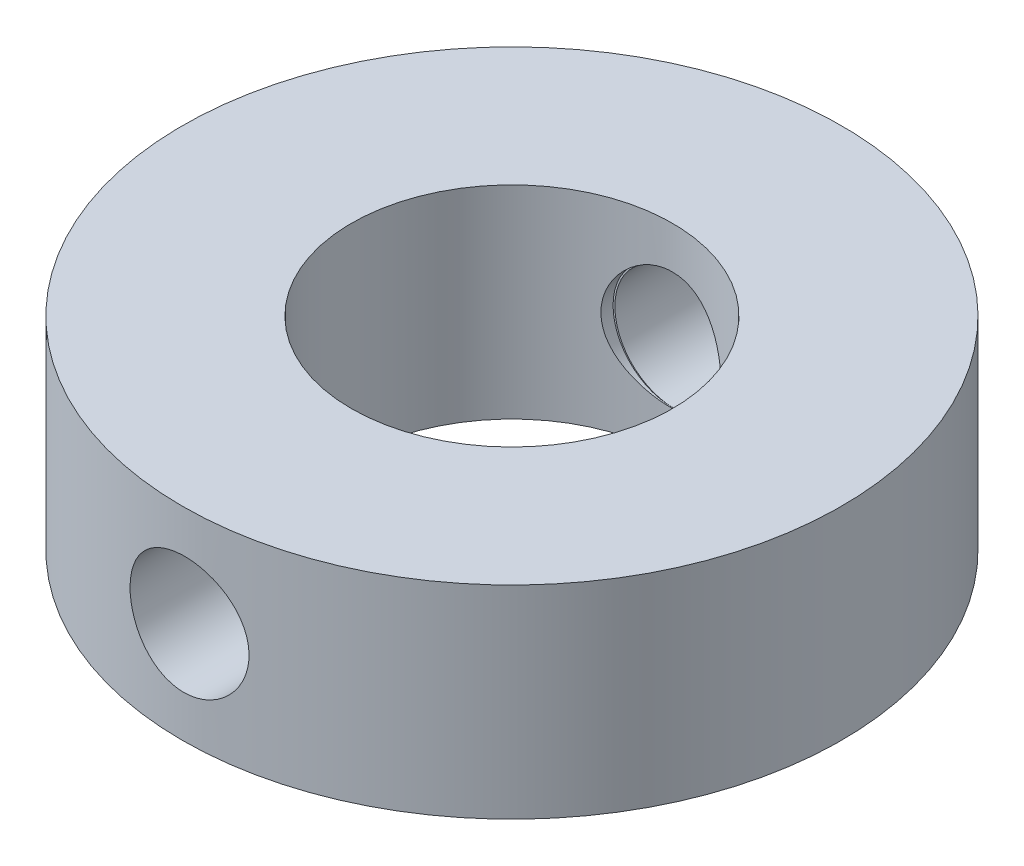
ISO-10303-21;
HEADER;
FILE_DESCRIPTION(('STEP AP214'),'2;1');
FILE_NAME('part.step','',(''),(''),'','','');
FILE_SCHEMA(('AUTOMOTIVE_DESIGN { 1 0 10303 214 1 1 1 1 }'));
ENDSEC;
DATA;
#1=APPLICATION_CONTEXT('core data for automotive mechanical design processes');
#2=APPLICATION_PROTOCOL_DEFINITION('international standard','automotive_design',2000,#1);
#3=PRODUCT_CONTEXT('',#1,'mechanical');
#4=PRODUCT('Part','Part','',(#3));
#5=PRODUCT_RELATED_PRODUCT_CATEGORY('part','',(#4));
#6=PRODUCT_DEFINITION_FORMATION('','',#4);
#7=PRODUCT_DEFINITION_CONTEXT('part definition',#1,'design');
#8=PRODUCT_DEFINITION('design','',#6,#7);
#9=PRODUCT_DEFINITION_SHAPE('','',#8);
#10=(LENGTH_UNIT() NAMED_UNIT(*) SI_UNIT(.MILLI.,.METRE.));
#11=(NAMED_UNIT(*) PLANE_ANGLE_UNIT() SI_UNIT($,.RADIAN.));
#12=(NAMED_UNIT(*) SI_UNIT($,.STERADIAN.) SOLID_ANGLE_UNIT());
#13=UNCERTAINTY_MEASURE_WITH_UNIT(LENGTH_MEASURE(1.E-05),#10,'distance_accuracy_value','');
#14=(GEOMETRIC_REPRESENTATION_CONTEXT(3) GLOBAL_UNCERTAINTY_ASSIGNED_CONTEXT((#13)) GLOBAL_UNIT_ASSIGNED_CONTEXT((#10,
#11,#12)) REPRESENTATION_CONTEXT('',''));
#15=CARTESIAN_POINT('',(0.,0.,0.));
#16=DIRECTION('',(0.,0.,1.));
#17=DIRECTION('',(1.,0.,0.));
#18=AXIS2_PLACEMENT_3D('',#15,#16,#17);
#19=CARTESIAN_POINT('',(0.,-1.5,0.));
#20=DIRECTION('',(0.,1.,0.));
#21=DIRECTION('',(0.,0.,1.));
#22=AXIS2_PLACEMENT_3D('',#19,#20,#21);
#23=CYLINDRICAL_SURFACE('',#22,4.875);
#24=CARTESIAN_POINT('',(0.,-0.874008492817964,4.875));
#25=CARTESIAN_POINT('',(0.0486550746432581,-0.875540677577028,4.87499913047076));
#26=CARTESIAN_POINT('',(0.0974633420716964,-0.873003741722209,4.87426403963422));
#27=CARTESIAN_POINT('',(0.193964599688848,-0.859855758819848,4.87137959041781));
#28=CARTESIAN_POINT('',(0.241656603969254,-0.849237832707096,4.86922902730671));
#29=CARTESIAN_POINT('',(0.334511748854439,-0.820261797158451,4.86373198307671));
#30=CARTESIAN_POINT('',(0.379676949101736,-0.801910098934879,4.86038649288867));
#31=CARTESIAN_POINT('',(0.466274379380257,-0.758009715978793,4.85284501621594));
#32=CARTESIAN_POINT('',(0.507706946211168,-0.732461681439914,4.84864910657681));
#33=CARTESIAN_POINT('',(0.586110708224433,-0.674608828105558,4.83980087880598));
#34=CARTESIAN_POINT('',(0.623035891095077,-0.642242257047889,4.83514461137277));
#35=CARTESIAN_POINT('',(0.690967212105215,-0.571788045789748,4.82590584117256));
#36=CARTESIAN_POINT('',(0.721972890062714,-0.533699961210057,4.8213233441658));
#37=CARTESIAN_POINT('',(0.777451600772404,-0.452478298832455,4.81269068434913));
#38=CARTESIAN_POINT('',(0.801865271268461,-0.409303595736562,4.80864551539872));
#39=CARTESIAN_POINT('',(0.84308337131779,-0.319384056260204,4.80159090032245));
#40=CARTESIAN_POINT('',(0.85988831997225,-0.272639463688007,4.79858138354311));
#41=CARTESIAN_POINT('',(0.885255779948881,-0.177360894570225,4.79396635188823));
#42=CARTESIAN_POINT('',(0.893893056677166,-0.12884745627224,4.79234811417186));
#43=CARTESIAN_POINT('',(0.902919879862713,-0.0310345336514618,4.7906557613465));
#44=CARTESIAN_POINT('',(0.903310172660453,0.0182648791376363,4.79058150650923));
#45=CARTESIAN_POINT('',(0.895881632553873,0.115570305799225,4.79197602661808));
#46=CARTESIAN_POINT('',(0.888169469412731,0.163584802280863,4.79342475151409));
#47=CARTESIAN_POINT('',(0.864939150137115,0.257623172506134,4.79767060681115));
#48=CARTESIAN_POINT('',(0.849420771585123,0.303646989490028,4.80046777563246));
#49=CARTESIAN_POINT('',(0.810965762096981,0.39260313722099,4.80711342609152));
#50=CARTESIAN_POINT('',(0.788001700296196,0.435523307363786,4.81096578691994));
#51=CARTESIAN_POINT('',(0.735321801764075,0.516931318281143,4.81929825458987));
#52=CARTESIAN_POINT('',(0.70560533244627,0.555418743273025,4.82377842023099));
#53=CARTESIAN_POINT('',(0.639746981336983,0.627461874323277,4.83295639568859));
#54=CARTESIAN_POINT('',(0.603517638908827,0.660937390763292,4.83765642786757));
#55=CARTESIAN_POINT('',(0.525924106375091,0.721349276099622,4.84670526223415));
#56=CARTESIAN_POINT('',(0.484559805539932,0.74828550394653,4.85105405684437));
#57=CARTESIAN_POINT('',(0.397701197251587,0.794916695894956,4.85894674255437));
#58=CARTESIAN_POINT('',(0.352195167738536,0.814590257049369,4.8624882430256));
#59=CARTESIAN_POINT('',(0.258445549580199,0.845987533535285,4.8683708102776));
#60=CARTESIAN_POINT('',(0.210202216452187,0.857711989567958,4.87071198889995));
#61=CARTESIAN_POINT('',(0.113013969891675,0.872744887861663,4.87392919011957));
#62=CARTESIAN_POINT('',(0.0640861926459796,0.876160185684961,4.87482376519561));
#63=CARTESIAN_POINT('',(-0.0336561018100031,0.874778995643791,4.8751287480019));
#64=CARTESIAN_POINT('',(-0.0824706251302325,0.869982961597966,4.87453923775278));
#65=CARTESIAN_POINT('',(-0.178164570163296,0.852407930897907,4.87197652112279));
#66=CARTESIAN_POINT('',(-0.225057023363525,0.83969794196351,4.87001525804703));
#67=CARTESIAN_POINT('',(-0.31604755898802,0.806740123691941,4.86495807686967));
#68=CARTESIAN_POINT('',(-0.360145487627501,0.786491879939753,4.86186209638721));
#69=CARTESIAN_POINT('',(-0.444724093322226,0.738830600268761,4.85485983708685));
#70=CARTESIAN_POINT('',(-0.485169649971442,0.71135627808341,4.8509466891419));
#71=CARTESIAN_POINT('',(-0.560918340092641,0.650092937120779,4.84277292297146));
#72=CARTESIAN_POINT('',(-0.596221012411317,0.616303352684563,4.83851227363951));
#73=CARTESIAN_POINT('',(-0.661151446413379,0.542845963216655,4.83007163213244));
#74=CARTESIAN_POINT('',(-0.690699791454943,0.503107697116525,4.82589339916885));
#75=CARTESIAN_POINT('',(-0.742704915000035,0.419177298688325,4.81816440600101));
#76=CARTESIAN_POINT('',(-0.765161842864886,0.374985260192663,4.81461363258174));
#77=CARTESIAN_POINT('',(-0.802265839813606,0.283509606062327,4.80857037531825));
#78=CARTESIAN_POINT('',(-0.816934615750747,0.236234999962687,4.80607495403221));
#79=CARTESIAN_POINT('',(-0.838099545509379,0.139841518740418,4.8024297127262));
#80=CARTESIAN_POINT('',(-0.844596552770775,0.0907228367605358,4.80127975219041));
#81=CARTESIAN_POINT('',(-0.849177516157899,-0.00719668459799078,4.80047161970514));
#82=CARTESIAN_POINT('',(-0.847382868682102,-0.0559917010243462,4.80079192150047));
#83=CARTESIAN_POINT('',(-0.835714851357985,-0.152574215128625,4.80283666723696));
#84=CARTESIAN_POINT('',(-0.825841618975586,-0.200361729936092,4.8045610872855));
#85=CARTESIAN_POINT('',(-0.798369984925171,-0.293417478551413,4.80920179106232));
#86=CARTESIAN_POINT('',(-0.780798278110189,-0.338693814153025,4.81211395384289));
#87=CARTESIAN_POINT('',(-0.738452136829417,-0.425672696433213,4.81879348936929));
#88=CARTESIAN_POINT('',(-0.713677286404992,-0.467375036544798,4.82256091150086));
#89=CARTESIAN_POINT('',(-0.65725039723749,-0.546610851741655,4.83057626555199));
#90=CARTESIAN_POINT('',(-0.625513066666696,-0.584083020390423,4.8348298120275));
#91=CARTESIAN_POINT('',(-0.556220291541886,-0.653218142900964,4.84329016392027));
#92=CARTESIAN_POINT('',(-0.518663457095326,-0.68487970503888,4.84749695791356));
#93=CARTESIAN_POINT('',(-0.438368920425869,-0.741786894936689,4.85541956995845));
#94=CARTESIAN_POINT('',(-0.395584647217396,-0.766967545386342,4.85913024896945));
#95=CARTESIAN_POINT('',(-0.306345943961674,-0.809753397987333,4.86556992438765));
#96=CARTESIAN_POINT('',(-0.25989504242102,-0.82736578059989,4.86829985088743));
#97=CARTESIAN_POINT('',(-0.177775970711532,-0.850767991423724,4.87188044066974));
#98=CARTESIAN_POINT('',(-0.142655531978864,-0.858477104915727,4.8730414540517));
#99=CARTESIAN_POINT('',(-0.0717178527761117,-0.86953203670433,4.87460154576962));
#100=CARTESIAN_POINT('',(-0.0359006283155674,-0.872877955131007,4.87500064159076));
#101=CARTESIAN_POINT('',(0.,-0.874008492817964,4.875));
#102=B_SPLINE_CURVE_WITH_KNOTS('',3,(#24,#25,#26,#27,#28,#29,#30,#31,#32,#33,#34,#35,#36,#37,
#38,#39,#40,#41,#42,#43,#44,#45,#46,#47,#48,#49,#50,#51,#52,#53,#54,#55,#56,#57,#58,#59,#60,#61,
#62,#63,#64,#65,#66,#67,#68,#69,#70,#71,#72,#73,#74,#75,#76,#77,#78,#79,#80,#81,#82,#83,#84,#85,
#86,#87,#88,#89,#90,#91,#92,#93,#94,#95,#96,#97,#98,#99,#100,#101),.UNSPECIFIED.,.T.,.F.,(4,2,2,
2,2,2,2,2,2,2,2,2,2,2,2,2,2,2,2,2,2,2,2,2,2,2,2,2,2,2,2,2,2,2,2,2,2,2,4),(0.,0.145906508533335,
0.29193736130696,0.437847393504514,0.583744246862652,0.73102406188876,0.878315321781778,
1.02689179370227,1.17545812754038,1.322650958273,1.46983046820384,1.61509633775001,
1.76036634649842,1.90617774864941,2.05200281650058,2.19995650993475,2.34791339437758,
2.49630288861651,2.64467855395495,2.79113578309524,2.93758491819227,3.08277459932099,
3.22797226342092,3.3744434899388,3.52092784219812,3.66930930470935,3.81768764176209,
3.96565022381718,4.11359735173193,4.25938533756667,4.40517084271163,4.55045478146395,
4.69574711156861,4.84292999797634,4.99014809092573,5.13878925050933,5.28728907242635,
5.39495010437135,5.50260866558174),.UNSPECIFIED.);
#103=CARTESIAN_POINT('',(0.,-0.874008492817964,4.875));
#104=VERTEX_POINT('',#103);
#105=EDGE_CURVE('E88',#104,#104,#102,.T.);
#106=ORIENTED_EDGE('',*,*,#105,.F.);
#107=EDGE_LOOP('',(#106));
#108=FACE_BOUND('',#107,.T.);
#109=CARTESIAN_POINT('',(-0.847858742388822,0.000556893820631739,-4.80070417261414));
#110=CARTESIAN_POINT('',(-0.847856830811218,0.0492794033549333,-4.80070508323596));
#111=CARTESIAN_POINT('',(-0.843771251441794,0.0980271022384331,-4.80143160397914));
#112=CARTESIAN_POINT('',(-0.827546689137651,0.194150640812315,-4.80425402282227));
#113=CARTESIAN_POINT('',(-0.815400637844369,0.241525238319247,-4.80635112278084));
#114=CARTESIAN_POINT('',(-0.78343891029995,0.333497726781807,-4.8116638544595));
#115=CARTESIAN_POINT('',(-0.76363008538385,0.378098056993318,-4.81487848672736));
#116=CARTESIAN_POINT('',(-0.7169244253036,0.463341789495463,-4.82205351166665));
#117=CARTESIAN_POINT('',(-0.690028240043811,0.503985554131751,-4.82601383594932));
#118=CARTESIAN_POINT('',(-0.629585992785282,0.580630060712666,-4.83427178714633));
#119=CARTESIAN_POINT('',(-0.595974758520152,0.616579088030808,-4.83857244847564));
#120=CARTESIAN_POINT('',(-0.523199641537306,0.682363635155636,-4.8469811579644));
#121=CARTESIAN_POINT('',(-0.484035408974398,0.712198769490318,-4.85108919396653));
#122=CARTESIAN_POINT('',(-0.400929988581807,0.765105206438486,-4.85866550381054));
#123=CARTESIAN_POINT('',(-0.356957454333129,0.788127994327008,-4.86212912656863));
#124=CARTESIAN_POINT('',(-0.2656968931663,0.826443934505085,-4.86796858951142));
#125=CARTESIAN_POINT('',(-0.218409116345371,0.841737669150552,-4.87034451164913));
#126=CARTESIAN_POINT('',(-0.122397098839721,0.864002132957819,-4.87369732993418));
#127=CARTESIAN_POINT('',(-0.0736935715585817,0.871059936152591,-4.87468888466628));
#128=CARTESIAN_POINT('',(0.0242134141600692,0.876923284250714,-4.87518556140636));
#129=CARTESIAN_POINT('',(0.0734168331406911,0.875729475485077,-4.87469079983602));
#130=CARTESIAN_POINT('',(0.170330646738561,0.865190715375301,-4.87226192646727));
#131=CARTESIAN_POINT('',(0.21805169695088,0.855939501290344,-4.87034440446747));
#132=CARTESIAN_POINT('',(0.311245789186282,0.829696532631136,-4.86527802923166));
#133=CARTESIAN_POINT('',(0.356718754403159,0.81270451379329,-4.86212913395827));
#134=CARTESIAN_POINT('',(0.444401703824126,0.7713714403271,-4.8549026188783));
#135=CARTESIAN_POINT('',(0.486593400583069,0.746992456771125,-4.85082023318878));
#136=CARTESIAN_POINT('',(0.566319018044189,0.691605365073948,-4.84216049720811));
#137=CARTESIAN_POINT('',(0.603852502837155,0.660596637268347,-4.83758310066939));
#138=CARTESIAN_POINT('',(0.67375266727232,0.592312380082558,-4.82834806710259));
#139=CARTESIAN_POINT('',(0.706039283366606,0.554954870678356,-4.82369020675787));
#140=CARTESIAN_POINT('',(0.763902366701103,0.475307820704042,-4.81486630067672));
#141=CARTESIAN_POINT('',(0.789478751285157,0.433018219390039,-4.81070026099884));
#142=CARTESIAN_POINT('',(0.833217257557209,0.344606596309166,-4.80331854858917));
#143=CARTESIAN_POINT('',(0.851368549356955,0.298479093847763,-4.80010426591728));
#144=CARTESIAN_POINT('',(0.879648801475482,0.203758032059632,-4.79500276506635));
#145=CARTESIAN_POINT('',(0.88977858926363,0.155164727646552,-4.79311541000851));
#146=CARTESIAN_POINT('',(0.901614081364375,0.0576111591825259,-4.79090317790265));
#147=CARTESIAN_POINT('',(0.903434333375424,0.0086652603983694,-4.79055705645957));
#148=CARTESIAN_POINT('',(0.898905585701333,-0.0888316769544349,-4.79140885993071));
#149=CARTESIAN_POINT('',(0.892556954514046,-0.137382733234987,-4.79260671519623));
#150=CARTESIAN_POINT('',(0.871968165590637,-0.232339912764373,-4.79639485595178));
#151=CARTESIAN_POINT('',(0.857787364676248,-0.278759358863856,-4.79897466381215));
#152=CARTESIAN_POINT('',(0.821998285941794,-0.368560812185135,-4.80523379762185));
#153=CARTESIAN_POINT('',(0.800389501062605,-0.41194261180357,-4.80891319863085));
#154=CARTESIAN_POINT('',(0.750089847882678,-0.494944541762359,-4.81701604532256));
#155=CARTESIAN_POINT('',(0.721326168253394,-0.534519804407173,-4.82144698147414));
#156=CARTESIAN_POINT('',(0.657630002665986,-0.608319191321524,-4.83054658873511));
#157=CARTESIAN_POINT('',(0.62269701041694,-0.642542875973422,-4.83521527933367));
#158=CARTESIAN_POINT('',(0.547141577660816,-0.705092156260397,-4.84434968099738));
#159=CARTESIAN_POINT('',(0.506455060538454,-0.733340889525323,-4.84881222967811));
#160=CARTESIAN_POINT('',(0.420843154249312,-0.782597560299983,-4.85699108698584));
#161=CARTESIAN_POINT('',(0.375917918457187,-0.803605759674775,-4.86070742259876));
#162=CARTESIAN_POINT('',(0.283320795932701,-0.837668135884033,-4.86698009235568));
#163=CARTESIAN_POINT('',(0.235663552142365,-0.850761039854272,-4.86954205852094));
#164=CARTESIAN_POINT('',(0.138774015823627,-0.86874523010964,-4.87326536584137));
#165=CARTESIAN_POINT('',(0.0895418750328565,-0.87363730411458,-4.8744268415158));
#166=CARTESIAN_POINT('',(-0.00836141060152593,-0.875055429137637,-4.87523521380992));
#167=CARTESIAN_POINT('',(-0.0570307341303996,-0.871697904421738,-4.87490313349528));
#168=CARTESIAN_POINT('',(-0.153107981316705,-0.856965866886914,-4.87283207630382));
#169=CARTESIAN_POINT('',(-0.200515914952999,-0.845591417509501,-4.8710931105603));
#170=CARTESIAN_POINT('',(-0.292668919813746,-0.815195763826863,-4.86642550137095));
#171=CARTESIAN_POINT('',(-0.337417849875456,-0.796185967542645,-4.86349863271048));
#172=CARTESIAN_POINT('',(-0.423113597754482,-0.751072774862085,-4.85679415702696));
#173=CARTESIAN_POINT('',(-0.46406018964109,-0.724968957308284,-4.8530164994966));
#174=CARTESIAN_POINT('',(-0.541570188438854,-0.666003155626268,-4.84498369965244));
#175=CARTESIAN_POINT('',(-0.578068671554441,-0.633056588433619,-4.84072291751457));
#176=CARTESIAN_POINT('',(-0.645059528097791,-0.561516936891755,-4.83225270577138));
#177=CARTESIAN_POINT('',(-0.675550490551474,-0.522922529746498,-4.82804328844727));
#178=CARTESIAN_POINT('',(-0.729896425980289,-0.440797500093067,-4.82012851017102));
#179=CARTESIAN_POINT('',(-0.753693760736671,-0.39722828995124,-4.8164276597641));
#180=CARTESIAN_POINT('',(-0.793588531993701,-0.306660723630206,-4.81001599915693));
#181=CARTESIAN_POINT('',(-0.809693406557294,-0.25966573083894,-4.8073042331846));
#182=CARTESIAN_POINT('',(-0.830381582951478,-0.177001926357459,-4.80376582435744));
#183=CARTESIAN_POINT('',(-0.836924547961789,-0.141824017167004,-4.80262450017396));
#184=CARTESIAN_POINT('',(-0.845663778140715,-0.0709162842885547,-4.80109334904963));
#185=CARTESIAN_POINT('',(-0.847860144743116,-0.0351864734995464,-4.80070350457199));
#186=CARTESIAN_POINT('',(-0.847858742388822,0.000556893820631739,-4.80070417261414));
#187=B_SPLINE_CURVE_WITH_KNOTS('',3,(#109,#110,#111,#112,#113,#114,#115,#116,#117,#118,#119,
#120,#121,#122,#123,#124,#125,#126,#127,#128,#129,#130,#131,#132,#133,#134,#135,#136,#137,#138,
#139,#140,#141,#142,#143,#144,#145,#146,#147,#148,#149,#150,#151,#152,#153,#154,#155,#156,#157,
#158,#159,#160,#161,#162,#163,#164,#165,#166,#167,#168,#169,#170,#171,#172,#173,#174,#175,#176,
#177,#178,#179,#180,#181,#182,#183,#184,#185,#186),.UNSPECIFIED.,.T.,.F.,(4,2,2,2,2,2,2,2,2,2,2,
2,2,2,2,2,2,2,2,2,2,2,2,2,2,2,2,2,2,2,2,2,2,2,2,2,2,2,4),(0.,0.146036764782426,
0.292201761092419,0.438236371281679,0.584257594890065,0.731771629123701,0.87929496104172,
1.02784491550466,1.17638367560211,1.32333736479462,1.47027954355126,1.61553473967837,
1.7607948950492,1.90681391539525,2.05284658971833,2.20093244854561,2.34902013139836,
2.49732304433033,2.64561065687609,2.7918478134071,2.93807837341963,3.08321562330398,
3.2283627827124,3.37505221005661,3.52175368121681,3.6702408099241,3.81872256780204,
3.96647184281242,4.11420692514943,4.25986907020811,4.40553006259003,4.55097422673753,
4.69642702749309,4.84379797415945,4.99120349238555,5.13984194670894,5.28833638578388,
5.39547305818109,5.50260723036887),.UNSPECIFIED.);
#188=CARTESIAN_POINT('',(-0.847858742388822,0.000556893820631739,-4.80070417261414));
#189=VERTEX_POINT('',#188);
#190=EDGE_CURVE('E87',#189,#189,#187,.T.);
#191=ORIENTED_EDGE('',*,*,#190,.F.);
#192=EDGE_LOOP('',(#191));
#193=FACE_BOUND('',#192,.T.);
#194=CARTESIAN_POINT('',(0.,-1.5,0.));
#195=DIRECTION('',(0.,1.,0.));
#196=DIRECTION('',(0.,0.,1.));
#197=AXIS2_PLACEMENT_3D('',#194,#195,#196);
#198=CIRCLE('',#197,4.875);
#199=CARTESIAN_POINT('',(0.,-1.5,4.875));
#200=VERTEX_POINT('',#199);
#201=EDGE_CURVE('E77',#200,#200,#198,.T.);
#202=ORIENTED_EDGE('',*,*,#201,.T.);
#203=EDGE_LOOP('',(#202));
#204=FACE_BOUND('',#203,.T.);
#205=CARTESIAN_POINT('',(0.,1.5,0.));
#206=DIRECTION('',(0.,1.,0.));
#207=DIRECTION('',(0.,0.,1.));
#208=AXIS2_PLACEMENT_3D('',#205,#206,#207);
#209=CIRCLE('',#208,4.875);
#210=CARTESIAN_POINT('',(0.,1.5,4.875));
#211=VERTEX_POINT('',#210);
#212=EDGE_CURVE('E166',#211,#211,#209,.T.);
#213=ORIENTED_EDGE('',*,*,#212,.F.);
#214=EDGE_LOOP('',(#213));
#215=FACE_BOUND('',#214,.T.);
#216=ADVANCED_FACE('F43',(#108,#193,#204,#215),#23,.T.);
#217=CARTESIAN_POINT('',(0.,-1.5,0.));
#218=DIRECTION('',(0.,1.,0.));
#219=DIRECTION('',(0.,0.,1.));
#220=AXIS2_PLACEMENT_3D('',#217,#218,#219);
#221=PLANE('',#220);
#222=CARTESIAN_POINT('',(0.,-1.5,0.));
#223=DIRECTION('',(0.,1.,0.));
#224=DIRECTION('',(0.,0.,1.));
#225=AXIS2_PLACEMENT_3D('',#222,#223,#224);
#226=CIRCLE('',#225,2.375);
#227=CARTESIAN_POINT('',(0.,-1.5,2.375));
#228=VERTEX_POINT('',#227);
#229=EDGE_CURVE('E163',#228,#228,#226,.T.);
#230=ORIENTED_EDGE('',*,*,#229,.T.);
#231=EDGE_LOOP('',(#230));
#232=FACE_BOUND('',#231,.T.);
#233=ORIENTED_EDGE('',*,*,#201,.F.);
#234=EDGE_LOOP('',(#233));
#235=FACE_BOUND('',#234,.T.);
#236=ADVANCED_FACE('F140',(#232,#235),#221,.F.);
#237=CARTESIAN_POINT('',(0.,-1.5,0.));
#238=DIRECTION('',(0.,1.,0.));
#239=DIRECTION('',(0.,0.,1.));
#240=AXIS2_PLACEMENT_3D('',#237,#238,#239);
#241=CYLINDRICAL_SURFACE('',#240,2.375);
#242=CARTESIAN_POINT('',(0.,-0.874339972909792,2.375));
#243=CARTESIAN_POINT('',(0.0473439512948802,-0.875068423987756,2.37500110787726));
#244=CARTESIAN_POINT('',(0.0947368856848246,-0.871939019373397,2.37357195256716));
#245=CARTESIAN_POINT('',(0.188229295700066,-0.858100452147242,2.36799215018307));
#246=CARTESIAN_POINT('',(0.234328948703509,-0.847392334319182,2.3638418782417));
#247=CARTESIAN_POINT('',(0.323870529464805,-0.818826629869472,2.35324550059043));
#248=CARTESIAN_POINT('',(0.367317090565465,-0.800981943525037,2.3468035397156));
#249=CARTESIAN_POINT('',(0.450581983472334,-0.758723133970585,2.33224990155108));
#250=CARTESIAN_POINT('',(0.490399367125475,-0.734307300541496,2.32413778971413));
#251=CARTESIAN_POINT('',(0.566879355370179,-0.67858102756933,2.30670054982775));
#252=CARTESIAN_POINT('',(0.603376000916186,-0.647053357614776,2.29734218484673));
#253=CARTESIAN_POINT('',(0.670706162283468,-0.578434200192254,2.27859647764738));
#254=CARTESIAN_POINT('',(0.70153795727685,-0.541341028271532,2.26920912750177));
#255=CARTESIAN_POINT('',(0.757873963472198,-0.460871306865178,2.25103625343374));
#256=CARTESIAN_POINT('',(0.783120380579953,-0.417304763322991,2.24228901837783));
#257=CARTESIAN_POINT('',(0.825873920833017,-0.326181574767246,2.22689852945206));
#258=CARTESIAN_POINT('',(0.843383706174329,-0.278626308996375,2.220254552069));
#259=CARTESIAN_POINT('',(0.86950721302758,-0.182670535149829,2.21015229329064));
#260=CARTESIAN_POINT('',(0.878420586632328,-0.134363258338123,2.2065871976485));
#261=CARTESIAN_POINT('',(0.888046448214133,-0.036817565255994,2.20273182154354));
#262=CARTESIAN_POINT('',(0.888762436835703,0.0124204445517278,2.20244014318837));
#263=CARTESIAN_POINT('',(0.882174548482604,0.107309084717654,2.20508553255548));
#264=CARTESIAN_POINT('',(0.875344589784609,0.152999057592231,2.20783181593259));
#265=CARTESIAN_POINT('',(0.854681030223469,0.242524405579422,2.21591222733305));
#266=CARTESIAN_POINT('',(0.840846516269174,0.286359538093603,2.22124669273963));
#267=CARTESIAN_POINT('',(0.806400022257295,0.371681300470249,2.2339838112945));
#268=CARTESIAN_POINT('',(0.785694980080309,0.413125961039066,2.24141464049016));
#269=CARTESIAN_POINT('',(0.738153895476487,0.492071602692211,2.25751685528069));
#270=CARTESIAN_POINT('',(0.711315830743687,0.529571276985193,2.26618864971874));
#271=CARTESIAN_POINT('',(0.650220556118395,0.602124924175416,2.28449507936179));
#272=CARTESIAN_POINT('',(0.615595392214429,0.636863161447052,2.29415569802498));
#273=CARTESIAN_POINT('',(0.540928850237179,0.700136549304517,2.31289885733688));
#274=CARTESIAN_POINT('',(0.500886540949715,0.728670631184581,2.32198129820049));
#275=CARTESIAN_POINT('',(0.415547573297556,0.779194852770155,2.33877497586514));
#276=CARTESIAN_POINT('',(0.37016731160239,0.801053957501037,2.34645769058903));
#277=CARTESIAN_POINT('',(0.276021148549005,0.83671665076813,2.35938341154209));
#278=CARTESIAN_POINT('',(0.227256661109126,0.850523581072889,2.3646274296822));
#279=CARTESIAN_POINT('',(0.130328755202661,0.869044648051073,2.37189437070356));
#280=CARTESIAN_POINT('',(0.0822563855580544,0.874177444208449,2.37406472676443));
#281=CARTESIAN_POINT('',(-0.0141138181843227,0.87644949680965,2.375446468233));
#282=CARTESIAN_POINT('',(-0.0624115966000002,0.873590632841873,2.37465854939346));
#283=CARTESIAN_POINT('',(-0.155852196395821,0.860275161556818,2.37032450902575));
#284=CARTESIAN_POINT('',(-0.201044245952446,0.85012355054946,2.36688871903404));
#285=CARTESIAN_POINT('',(-0.289060987397287,0.82293372094827,2.35775908379992));
#286=CARTESIAN_POINT('',(-0.331885400801771,0.805894694200391,2.35206497357271));
#287=CARTESIAN_POINT('',(-0.415199637394104,0.764943306174732,2.33881609327927));
#288=CARTESIAN_POINT('',(-0.455600323588989,0.740864429097164,2.33121697102916));
#289=CARTESIAN_POINT('',(-0.531920230631463,0.686691970697466,2.31499688078551));
#290=CARTESIAN_POINT('',(-0.567837868374913,0.656596274355006,2.30637555390352));
#291=CARTESIAN_POINT('',(-0.636297407165159,0.589244462719329,2.28846526267344));
#292=CARTESIAN_POINT('',(-0.668533791367788,0.551679791196651,2.27916610358746));
#293=CARTESIAN_POINT('',(-0.726311374055488,0.471520969866268,2.26141832632764));
#294=CARTESIAN_POINT('',(-0.751851812043624,0.428926249563294,2.25296980483264));
#295=CARTESIAN_POINT('',(-0.795614891748688,0.339430203779982,2.23789279230919));
#296=CARTESIAN_POINT('',(-0.813784620641187,0.292500608247866,2.23127756577819));
#297=CARTESIAN_POINT('',(-0.841836887777868,0.195937377896157,2.22084748122586));
#298=CARTESIAN_POINT('',(-0.851724275346504,0.146305343515407,2.21703098470681));
#299=CARTESIAN_POINT('',(-0.86244145647412,0.0489921821199801,2.21288278821886));
#300=CARTESIAN_POINT('',(-0.863785118855009,0.00137576474007302,2.2123534295756));
#301=CARTESIAN_POINT('',(-0.858724367511011,-0.0933750308129837,2.21432264501948));
#302=CARTESIAN_POINT('',(-0.852320878719454,-0.140509465852584,2.21682085764459));
#303=CARTESIAN_POINT('',(-0.832368688771834,-0.231392850783994,2.22438634067263));
#304=CARTESIAN_POINT('',(-0.819058699170204,-0.27520203158098,2.22936757604696));
#305=CARTESIAN_POINT('',(-0.785899718668503,-0.359986693335144,2.24127091049979));
#306=CARTESIAN_POINT('',(-0.766049162950341,-0.400961493330843,2.24819347397832));
#307=CARTESIAN_POINT('',(-0.71926739417971,-0.481071084654393,2.26360615419379));
#308=CARTESIAN_POINT('',(-0.692040774224961,-0.520021727763119,2.27215578547414));
#309=CARTESIAN_POINT('',(-0.631714827733464,-0.592977223710947,2.28966085985765));
#310=CARTESIAN_POINT('',(-0.598613652566926,-0.626980513548455,2.2986164300409));
#311=CARTESIAN_POINT('',(-0.52535137670341,-0.690953331677255,2.31648987800054));
#312=CARTESIAN_POINT('',(-0.484905688853475,-0.720606161282007,2.32537964219414));
#313=CARTESIAN_POINT('',(-0.399313852784246,-0.77270326424082,2.34159537401429));
#314=CARTESIAN_POINT('',(-0.354167357874737,-0.795147005416538,2.34892122617872));
#315=CARTESIAN_POINT('',(-0.258658959846491,-0.832724847457178,2.36138095327448));
#316=CARTESIAN_POINT('',(-0.208166187394077,-0.847559173004863,2.36642412473689));
#317=CARTESIAN_POINT('',(-0.105135082505506,-0.867959810360308,2.37323222574823));
#318=CARTESIAN_POINT('',(-0.0525977701212092,-0.873530684684045,2.37499876918018));
#319=CARTESIAN_POINT('',(0.,-0.874339972909792,2.375));
#320=B_SPLINE_CURVE_WITH_KNOTS('',3,(#242,#243,#244,#245,#246,#247,#248,#249,#250,#251,#252,
#253,#254,#255,#256,#257,#258,#259,#260,#261,#262,#263,#264,#265,#266,#267,#268,#269,#270,#271,
#272,#273,#274,#275,#276,#277,#278,#279,#280,#281,#282,#283,#284,#285,#286,#287,#288,#289,#290,
#291,#292,#293,#294,#295,#296,#297,#298,#299,#300,#301,#302,#303,#304,#305,#306,#307,#308,#309,
#310,#311,#312,#313,#314,#315,#316,#317,#318,#319),.UNSPECIFIED.,.T.,.F.,(4,2,2,2,2,2,2,2,2,2,2,
2,2,2,2,2,2,2,2,2,2,2,2,2,2,2,2,2,2,2,2,2,2,2,2,2,2,2,4),(0.,0.141855719070252,
0.283691886049947,0.425272816220978,0.566890630203685,0.713625100154128,0.860404070624605,
1.012966610255,1.16547661173925,1.31245455136908,1.45936972260142,1.59755693794697,
1.73576217157025,1.87592151500707,2.01612714151511,2.16541409145535,2.31472673669795,
2.46680571778885,2.61882153891216,2.76326539435523,2.90767528036686,3.04637313302984,
3.18508726491689,3.32739238833412,3.46974762279799,3.62014841019306,3.7705662720735,
3.92204561694572,4.07343620829705,4.2156277013378,4.35780221979385,4.49536117206432,
4.63295305898032,4.7771831822534,4.92145877320806,5.07352003990507,5.22559252925884,
5.38326784155328,5.54086547119689),.UNSPECIFIED.);
#321=CARTESIAN_POINT('',(0.,-0.874339972909792,2.375));
#322=VERTEX_POINT('',#321);
#323=EDGE_CURVE('E96',#322,#322,#320,.T.);
#324=ORIENTED_EDGE('',*,*,#323,.T.);
#325=EDGE_LOOP('',(#324));
#326=FACE_BOUND('',#325,.T.);
#327=CARTESIAN_POINT('',(-0.862496954556859,0.000556893820631739,-2.21285426618658));
#328=CARTESIAN_POINT('',(-0.862498444159635,0.0478787461462343,-2.21285292114518));
#329=CARTESIAN_POINT('',(-0.858636612823819,0.0951906305460327,-2.21437033791841));
#330=CARTESIAN_POINT('',(-0.843359411752321,0.188391975102002,-2.22023331322484));
#331=CARTESIAN_POINT('',(-0.831944054516214,0.234281437611865,-2.22457886707804));
#332=CARTESIAN_POINT('',(-0.8020343250042,0.323267387051256,-2.23553488366643));
#333=CARTESIAN_POINT('',(-0.783556388244687,0.366370088873175,-2.24214008420002));
#334=CARTESIAN_POINT('',(-0.740107088737295,0.448886476953294,-2.25685420436175));
#335=CARTESIAN_POINT('',(-0.715133850355133,0.488299093155188,-2.26496355814663));
#336=CARTESIAN_POINT('',(-0.658124326293259,0.564206031286982,-2.28219637078091));
#337=CARTESIAN_POINT('',(-0.625827647410988,0.600498301120221,-2.29134862386621));
#338=CARTESIAN_POINT('',(-0.555646562593414,0.667301963153953,-2.30937074277589));
#339=CARTESIAN_POINT('',(-0.517761020021672,0.697812176536881,-2.31824055071071));
#340=CARTESIAN_POINT('',(-0.435955566028107,0.753149504369424,-2.33502994336504));
#341=CARTESIAN_POINT('',(-0.391878906123219,0.777758296962006,-2.3429089992384));
#342=CARTESIAN_POINT('',(-0.299871015920023,0.819136102621775,-2.35645074957853));
#343=CARTESIAN_POINT('',(-0.251941078746604,0.835907733003911,-2.36211418387586));
#344=CARTESIAN_POINT('',(-0.155714511707402,0.860430383043397,-2.37036098119024));
#345=CARTESIAN_POINT('',(-0.10751684694568,0.868528972406508,-2.37306313156768));
#346=CARTESIAN_POINT('',(-0.0103775629818573,0.876587906730042,-2.37547358092426));
#347=CARTESIAN_POINT('',(0.0385638178625264,0.876550806341952,-2.37518281972148));
#348=CARTESIAN_POINT('',(0.133315647348094,0.868544814812496,-2.37170695388665));
#349=CARTESIAN_POINT('',(0.179163964225848,0.860954979248128,-2.36866080105776));
#350=CARTESIAN_POINT('',(0.26886980417837,0.838694805804616,-2.36016206967249));
#351=CARTESIAN_POINT('',(0.312727186664468,0.82402396875294,-2.3547093214664));
#352=CARTESIAN_POINT('',(0.397955393013491,0.787834975337322,-2.34182458133165));
#353=CARTESIAN_POINT('',(0.439281423779954,0.766221444185058,-2.33436527129438));
#354=CARTESIAN_POINT('',(0.517813666651679,0.71684394689071,-2.31821132555262));
#355=CARTESIAN_POINT('',(0.555018570269738,0.689078035672143,-2.30951629948867));
#356=CARTESIAN_POINT('',(0.626490089506367,0.626343452905362,-2.29119467991283));
#357=CARTESIAN_POINT('',(0.660470775871837,0.591055808636153,-2.28154321795167));
#358=CARTESIAN_POINT('',(0.72213956433195,0.515212684238904,-2.26278166573252));
#359=CARTESIAN_POINT('',(0.749826197308383,0.474655977704074,-2.25367170223341));
#360=CARTESIAN_POINT('',(0.798644358335209,0.388335610609801,-2.23684489648513));
#361=CARTESIAN_POINT('',(0.819627786941334,0.342481294702979,-2.22916092073993));
#362=CARTESIAN_POINT('',(0.853482783378899,0.247530894990614,-2.21642127115761));
#363=CARTESIAN_POINT('',(0.866358676751624,0.198436555279816,-2.21136419606604));
#364=CARTESIAN_POINT('',(0.882998625813392,0.101215623361302,-2.20477090228615));
#365=CARTESIAN_POINT('',(0.887213998969507,0.0531781586887485,-2.203060527258));
#366=CARTESIAN_POINT('',(0.887712358840747,-0.0429384729770343,-2.2028600830135));
#367=CARTESIAN_POINT('',(0.883997230293461,-0.091017627347939,-2.20436924865138));
#368=CARTESIAN_POINT('',(0.869147910172476,-0.183578071043693,-2.21026352568837));
#369=CARTESIAN_POINT('',(0.858356517492343,-0.228123769047444,-2.2145156126824));
#370=CARTESIAN_POINT('',(0.830087027605853,-0.314749864781677,-2.22526573293691));
#371=CARTESIAN_POINT('',(0.812607589494751,-0.356829766185568,-2.23176421655843));
#372=CARTESIAN_POINT('',(0.77073380823598,-0.439042356475734,-2.24657593469826));
#373=CARTESIAN_POINT('',(0.746109697589909,-0.479047322519233,-2.25494690697458));
#374=CARTESIAN_POINT('',(0.690888412293485,-0.554510678084739,-2.27247359827121));
#375=CARTESIAN_POINT('',(0.660289118152398,-0.58996744687404,-2.28162959510364));
#376=CARTESIAN_POINT('',(0.591779047954224,-0.657562977321295,-2.30038190802775));
#377=CARTESIAN_POINT('',(0.553536841179662,-0.689368917954155,-2.30997114775815));
#378=CARTESIAN_POINT('',(0.472021454122337,-0.746139845880427,-2.32799502104831));
#379=CARTESIAN_POINT('',(0.428748297720647,-0.771104865644656,-2.33642966008835));
#380=CARTESIAN_POINT('',(0.338460876485019,-0.813306724164189,-2.35120195292906));
#381=CARTESIAN_POINT('',(0.291462813541875,-0.830575078351753,-2.35754812984352));
#382=CARTESIAN_POINT('',(0.194939849577635,-0.856862358343848,-2.36748228848154));
#383=CARTESIAN_POINT('',(0.145416100310594,-0.865885009430441,-2.37107151563564));
#384=CARTESIAN_POINT('',(0.0482590210615876,-0.875033604263265,-2.37497923162492));
#385=CARTESIAN_POINT('',(0.000676841149726523,-0.87563312564524,-2.37547095624825));
#386=CARTESIAN_POINT('',(-0.0938964921436243,-0.86912838382269,-2.37361422901377));
#387=CARTESIAN_POINT('',(-0.140887712056389,-0.862024995822852,-2.3712660998167));
#388=CARTESIAN_POINT('',(-0.231854588249813,-0.84064631883607,-2.36408649142591));
#389=CARTESIAN_POINT('',(-0.275874647221275,-0.826538895575711,-2.35931307919058));
#390=CARTESIAN_POINT('',(-0.360940458615638,-0.791717605085863,-2.34780562782328));
#391=CARTESIAN_POINT('',(-0.401985647464114,-0.771002490055695,-2.34107121839631));
#392=CARTESIAN_POINT('',(-0.481791191237851,-0.72257750477621,-2.32598795135819));
#393=CARTESIAN_POINT('',(-0.520386933691353,-0.69461386279175,-2.31758385941374));
#394=CARTESIAN_POINT('',(-0.592489781011199,-0.632890654020529,-2.30020840741964));
#395=CARTESIAN_POINT('',(-0.62599508855487,-0.599129049019976,-2.29123684858587));
#396=CARTESIAN_POINT('',(-0.688700363861814,-0.524739231217888,-2.27319943543634));
#397=CARTESIAN_POINT('',(-0.717597470087078,-0.483850357517424,-2.26415169838546));
#398=CARTESIAN_POINT('',(-0.768108764437818,-0.397513799006519,-2.24751949808669));
#399=CARTESIAN_POINT('',(-0.789722677274239,-0.352065941960545,-2.23993509015414));
#400=CARTESIAN_POINT('',(-0.825420398748025,-0.256444170584372,-2.22703405695972));
#401=CARTESIAN_POINT('',(-0.839268248733032,-0.206171563258066,-2.22178939349755));
#402=CARTESIAN_POINT('',(-0.857802971590729,-0.103742209309449,-2.21470125431903));
#403=CARTESIAN_POINT('',(-0.86249531317769,-0.0515866064025214,-2.21285574827494));
#404=CARTESIAN_POINT('',(-0.862496954556859,0.000556893820631739,-2.21285426618658));
#405=B_SPLINE_CURVE_WITH_KNOTS('',3,(#327,#328,#329,#330,#331,#332,#333,#334,#335,#336,#337,
#338,#339,#340,#341,#342,#343,#344,#345,#346,#347,#348,#349,#350,#351,#352,#353,#354,#355,#356,
#357,#358,#359,#360,#361,#362,#363,#364,#365,#366,#367,#368,#369,#370,#371,#372,#373,#374,#375,
#376,#377,#378,#379,#380,#381,#382,#383,#384,#385,#386,#387,#388,#389,#390,#391,#392,#393,#394,
#395,#396,#397,#398,#399,#400,#401,#402,#403,#404),.UNSPECIFIED.,.T.,.F.,(4,2,2,2,2,2,2,2,2,2,2,
2,2,2,2,2,2,2,2,2,2,2,2,2,2,2,2,2,2,2,2,2,2,2,2,2,2,2,4),(0.,0.141771562037287,
0.283542889471556,0.424986286252306,0.566470572774179,0.714121184195309,0.861801865597787,
1.01430901737514,1.16676520108346,1.3128524734131,1.45889387359861,1.59795760124505,
1.73703113356873,1.87810333202332,2.0192201942856,2.16833283430571,2.31748024360236,
2.46972556262818,2.62188958658365,2.76589929379353,2.90987477992887,3.04734504170778,
3.18484287973453,3.32737549886918,3.46995876868875,3.62121138690015,3.77246328717003,
3.92309003709755,4.07364870248233,4.21570622686399,4.35774761235846,4.49653806693354,
4.63535474631733,4.77991038567093,4.92451694647555,5.0764260439787,5.22834088267529,
5.38465101702548,5.54086775651115),.UNSPECIFIED.);
#406=CARTESIAN_POINT('',(0.,0.875453760551056,-2.375));
#407=VERTEX_POINT('',#406);
#408=CARTESIAN_POINT('',(0.,-0.874339972909793,-2.375));
#409=VERTEX_POINT('',#408);
#410=EDGE_CURVE('E82',#407,#409,#405,.T.);
#411=ORIENTED_EDGE('',*,*,#410,.T.);
#412=CARTESIAN_POINT('',(0.862496954556857,0.000556893820631739,-2.21285426618658));
#413=CARTESIAN_POINT('',(0.862498444159632,-0.0467649585049708,-2.21285292114518));
#414=CARTESIAN_POINT('',(0.858636612823817,-0.0940768429047692,-2.21437033791841));
#415=CARTESIAN_POINT('',(0.843359411752319,-0.187278187460738,-2.22023331322484));
#416=CARTESIAN_POINT('',(0.831944054516212,-0.233167649970601,-2.22457886707804));
#417=CARTESIAN_POINT('',(0.802034325004198,-0.322153599409993,-2.23553488366643));
#418=CARTESIAN_POINT('',(0.783556388244685,-0.365256301231912,-2.24214008420002));
#419=CARTESIAN_POINT('',(0.740107088737293,-0.447772689312031,-2.25685420436175));
#420=CARTESIAN_POINT('',(0.715133850355131,-0.487185305513924,-2.26496355814664));
#421=CARTESIAN_POINT('',(0.658124326293257,-0.563092243645719,-2.28219637078091));
#422=CARTESIAN_POINT('',(0.625827647410986,-0.599384513478957,-2.29134862386621));
#423=CARTESIAN_POINT('',(0.555646562593412,-0.666188175512689,-2.30937074277589));
#424=CARTESIAN_POINT('',(0.51776102002167,-0.696698388895618,-2.31824055071071));
#425=CARTESIAN_POINT('',(0.435955566028105,-0.75203571672816,-2.33502994336504));
#426=CARTESIAN_POINT('',(0.391878906123217,-0.776644509320743,-2.3429089992384));
#427=CARTESIAN_POINT('',(0.299871015920021,-0.818022314980512,-2.35645074957853));
#428=CARTESIAN_POINT('',(0.251941078746602,-0.834793945362647,-2.36211418387586));
#429=CARTESIAN_POINT('',(0.155714511707399,-0.859316595402134,-2.37036098119024));
#430=CARTESIAN_POINT('',(0.107516846945677,-0.867415184765245,-2.37306313156768));
#431=CARTESIAN_POINT('',(0.0103775629818551,-0.875474119088779,-2.37547358092426));
#432=CARTESIAN_POINT('',(-0.0385638178625287,-0.875437018700688,-2.37518281972148));
#433=CARTESIAN_POINT('',(-0.133315647348096,-0.867431027171232,-2.37170695388665));
#434=CARTESIAN_POINT('',(-0.17916396422585,-0.859841191606864,-2.36866080105776));
#435=CARTESIAN_POINT('',(-0.268869804178373,-0.837581018163352,-2.36016206967249));
#436=CARTESIAN_POINT('',(-0.31272718666447,-0.822910181111676,-2.3547093214664));
#437=CARTESIAN_POINT('',(-0.397955393013493,-0.786721187696058,-2.34182458133165));
#438=CARTESIAN_POINT('',(-0.439281423779956,-0.765107656543794,-2.33436527129438));
#439=CARTESIAN_POINT('',(-0.517813666651681,-0.715730159249446,-2.31821132555262));
#440=CARTESIAN_POINT('',(-0.555018570269741,-0.687964248030879,-2.30951629948867));
#441=CARTESIAN_POINT('',(-0.626490089506369,-0.625229665264098,-2.29119467991283));
#442=CARTESIAN_POINT('',(-0.66047077587184,-0.58994202099489,-2.28154321795167));
#443=CARTESIAN_POINT('',(-0.722139564331952,-0.51409889659764,-2.26278166573252));
#444=CARTESIAN_POINT('',(-0.749826197308385,-0.47354219006281,-2.25367170223341));
#445=CARTESIAN_POINT('',(-0.798644358335211,-0.387221822968537,-2.23684489648513));
#446=CARTESIAN_POINT('',(-0.819627786941336,-0.341367507061715,-2.22916092073993));
#447=CARTESIAN_POINT('',(-0.853482783378901,-0.246417107349351,-2.21642127115761));
#448=CARTESIAN_POINT('',(-0.866358676751626,-0.197322767638552,-2.21136419606603));
#449=CARTESIAN_POINT('',(-0.882998625813394,-0.100101835720038,-2.20477090228615));
#450=CARTESIAN_POINT('',(-0.887213998969509,-0.0520643710474846,-2.203060527258));
#451=CARTESIAN_POINT('',(-0.887712358840749,0.0440522606182982,-2.20286008301349));
#452=CARTESIAN_POINT('',(-0.883997230293463,0.0921314149892029,-2.20436924865137));
#453=CARTESIAN_POINT('',(-0.869147910172478,0.184691858684957,-2.21026352568837));
#454=CARTESIAN_POINT('',(-0.858356517492345,0.229237556688707,-2.2145156126824));
#455=CARTESIAN_POINT('',(-0.830087027605855,0.31586365242294,-2.22526573293691));
#456=CARTESIAN_POINT('',(-0.812607589494753,0.357943553826832,-2.23176421655843));
#457=CARTESIAN_POINT('',(-0.770733808235982,0.440156144116998,-2.24657593469826));
#458=CARTESIAN_POINT('',(-0.746109697589911,0.480161110160496,-2.25494690697458));
#459=CARTESIAN_POINT('',(-0.690888412293486,0.555624465726002,-2.27247359827121));
#460=CARTESIAN_POINT('',(-0.660289118152399,0.591081234515304,-2.28162959510364));
#461=CARTESIAN_POINT('',(-0.591779047954226,0.658676764962559,-2.30038190802775));
#462=CARTESIAN_POINT('',(-0.553536841179664,0.690482705595419,-2.30997114775815));
#463=CARTESIAN_POINT('',(-0.472021454122338,0.747253633521691,-2.32799502104831));
#464=CARTESIAN_POINT('',(-0.428748297720649,0.77221865328592,-2.33642966008835));
#465=CARTESIAN_POINT('',(-0.338460876485021,0.814420511805453,-2.35120195292906));
#466=CARTESIAN_POINT('',(-0.291462813541877,0.831688865993017,-2.35754812984352));
#467=CARTESIAN_POINT('',(-0.194939849577637,0.857976145985112,-2.36748228848154));
#468=CARTESIAN_POINT('',(-0.145416100310596,0.866998797071705,-2.37107151563564));
#469=CARTESIAN_POINT('',(-0.0482590210615893,0.876147391904529,-2.37497923162492));
#470=CARTESIAN_POINT('',(-0.000676841149728237,0.876746913286503,-2.37547095624825));
#471=CARTESIAN_POINT('',(0.0938964921436226,0.870242171463953,-2.37361422901377));
#472=CARTESIAN_POINT('',(0.140887712056387,0.863138783464116,-2.3712660998167));
#473=CARTESIAN_POINT('',(0.231854588249811,0.841760106477334,-2.36408649142591));
#474=CARTESIAN_POINT('',(0.275874647221274,0.827652683216974,-2.35931307919058));
#475=CARTESIAN_POINT('',(0.360940458615636,0.792831392727126,-2.34780562782328));
#476=CARTESIAN_POINT('',(0.401985647464112,0.772116277696958,-2.34107121839631));
#477=CARTESIAN_POINT('',(0.481791191237849,0.723691292417473,-2.32598795135819));
#478=CARTESIAN_POINT('',(0.520386933691351,0.695727650433013,-2.31758385941374));
#479=CARTESIAN_POINT('',(0.592489781011197,0.634004441661792,-2.30020840741964));
#480=CARTESIAN_POINT('',(0.625995088554868,0.600242836661239,-2.29123684858587));
#481=CARTESIAN_POINT('',(0.688700363861812,0.525853018859151,-2.27319943543634));
#482=CARTESIAN_POINT('',(0.717597470087077,0.484964145158687,-2.26415169838546));
#483=CARTESIAN_POINT('',(0.768108764437816,0.398627586647781,-2.24751949808669));
#484=CARTESIAN_POINT('',(0.789722677274237,0.353179729601808,-2.23993509015414));
#485=CARTESIAN_POINT('',(0.825420398748023,0.257557958225635,-2.22703405695972));
#486=CARTESIAN_POINT('',(0.83926824873303,0.207285350899328,-2.22178939349755));
#487=CARTESIAN_POINT('',(0.857802971590727,0.104855996950712,-2.21470125431903));
#488=CARTESIAN_POINT('',(0.862495313177688,0.0527003940437846,-2.21285574827494));
#489=CARTESIAN_POINT('',(0.862496954556857,0.000556893820631739,-2.21285426618658));
#490=B_SPLINE_CURVE_WITH_KNOTS('',3,(#412,#413,#414,#415,#416,#417,#418,#419,#420,#421,#422,
#423,#424,#425,#426,#427,#428,#429,#430,#431,#432,#433,#434,#435,#436,#437,#438,#439,#440,#441,
#442,#443,#444,#445,#446,#447,#448,#449,#450,#451,#452,#453,#454,#455,#456,#457,#458,#459,#460,
#461,#462,#463,#464,#465,#466,#467,#468,#469,#470,#471,#472,#473,#474,#475,#476,#477,#478,#479,
#480,#481,#482,#483,#484,#485,#486,#487,#488,#489),.UNSPECIFIED.,.T.,.F.,(4,2,2,2,2,2,2,2,2,2,2,
2,2,2,2,2,2,2,2,2,2,2,2,2,2,2,2,2,2,2,2,2,2,2,2,2,2,2,4),(0.,0.141771562037287,
0.283542889471556,0.424986286252306,0.566470572774179,0.714121184195309,0.861801865597787,
1.01430901737514,1.16676520108346,1.3128524734131,1.45889387359861,1.59795760124505,
1.73703113356873,1.87810333202332,2.0192201942856,2.16833283430571,2.31748024360236,
2.46972556262818,2.62188958658365,2.76589929379353,2.90987477992887,3.04734504170778,
3.18484287973453,3.32737549886918,3.46995876868875,3.62121138690015,3.77246328717003,
3.92309003709755,4.07364870248233,4.21570622686399,4.35774761235846,4.49653806693354,
4.63535474631733,4.77991038567093,4.92451694647555,5.0764260439787,5.22834088267529,
5.38465101702548,5.54086775651115),.UNSPECIFIED.);
#491=EDGE_CURVE('E70',#409,#407,#490,.T.);
#492=ORIENTED_EDGE('',*,*,#491,.T.);
#493=EDGE_LOOP('',(#411,#492));
#494=FACE_BOUND('',#493,.T.);
#495=ORIENTED_EDGE('',*,*,#229,.F.);
#496=EDGE_LOOP('',(#495));
#497=FACE_BOUND('',#496,.T.);
#498=CARTESIAN_POINT('',(0.,1.5,0.));
#499=DIRECTION('',(0.,1.,0.));
#500=DIRECTION('',(0.,0.,1.));
#501=AXIS2_PLACEMENT_3D('',#498,#499,#500);
#502=CIRCLE('',#501,2.375);
#503=CARTESIAN_POINT('',(0.,1.5,2.375));
#504=VERTEX_POINT('',#503);
#505=EDGE_CURVE('E93',#504,#504,#502,.T.);
#506=ORIENTED_EDGE('',*,*,#505,.T.);
#507=EDGE_LOOP('',(#506));
#508=FACE_BOUND('',#507,.T.);
#509=ADVANCED_FACE('F84',(#326,#494,#497,#508),#241,.F.);
#510=CARTESIAN_POINT('',(0.,1.5,0.));
#511=DIRECTION('',(0.,1.,0.));
#512=DIRECTION('',(0.,0.,1.));
#513=AXIS2_PLACEMENT_3D('',#510,#511,#512);
#514=PLANE('',#513);
#515=ORIENTED_EDGE('',*,*,#212,.T.);
#516=EDGE_LOOP('',(#515));
#517=FACE_BOUND('',#516,.T.);
#518=ORIENTED_EDGE('',*,*,#505,.F.);
#519=EDGE_LOOP('',(#518));
#520=FACE_BOUND('',#519,.T.);
#521=ADVANCED_FACE('F118',(#517,#520),#514,.T.);
#522=CARTESIAN_POINT('',(0.0275750701482632,0.000556893820631739,-4.87492201122298));
#523=DIRECTION('',(0.00565642464579779,0.,-0.99998400230215));
#524=DIRECTION('',(-0.99998400230215,0.,-0.00565642464579779));
#525=AXIS2_PLACEMENT_3D('',#522,#523,#524);
#526=CYLINDRICAL_SURFACE('',#525,0.874999999999999);
#527=ORIENTED_EDGE('',*,*,#410,.F.);
#528=CARTESIAN_POINT('',(0.,0.000556893820631739,3.45990597283574E-12));
#529=DIRECTION('',(1.,0.,0.));
#530=DIRECTION('',(0.,0.,-1.));
#531=AXIS2_PLACEMENT_3D('',#528,#529,#530);
#532=ELLIPSE('',#531,154.691356252761,0.874999999999999);
#533=CARTESIAN_POINT('',(-4.02512936447264E-12,0.875452502573475,-2.38943987996553));
#534=VERTEX_POINT('',#533);
#535=EDGE_CURVE('E11',#407,#534,#532,.F.);
#536=ORIENTED_EDGE('',*,*,#535,.T.);
#537=CARTESIAN_POINT('',(0.013516335320893,0.000556893820631739,-2.38951633532089));
#538=DIRECTION('',(-0.00565642464579779,0.,-0.99998400230215));
#539=DIRECTION('',(0.99998400230215,0.,-0.00565642464579779));
#540=AXIS2_PLACEMENT_3D('',#537,#538,#539);
#541=ELLIPSE('',#540,0.875055995077744,0.874999999999999);
#542=CARTESIAN_POINT('',(-4.02512936447264E-12,-0.874338714932211,-2.38943987996553));
#543=VERTEX_POINT('',#542);
#544=EDGE_CURVE('E62',#534,#543,#541,.F.);
#545=ORIENTED_EDGE('',*,*,#544,.T.);
#546=EDGE_CURVE('E47',#543,#409,#532,.F.);
#547=ORIENTED_EDGE('',*,*,#546,.T.);
#548=EDGE_LOOP('',(#527,#536,#545,#547));
#549=FACE_BOUND('',#548,.T.);
#550=ORIENTED_EDGE('',*,*,#190,.T.);
#551=EDGE_LOOP('',(#550));
#552=FACE_BOUND('',#551,.T.);
#553=ADVANCED_FACE('F80',(#549,#552),#526,.F.);
#554=CARTESIAN_POINT('',(0.0275750701482632,0.000556893820631739,4.87492201122298));
#555=DIRECTION('',(0.00565642464579779,0.,0.99998400230215));
#556=DIRECTION('',(0.99998400230215,0.,-0.00565642464579779));
#557=AXIS2_PLACEMENT_3D('',#554,#555,#556);
#558=CYLINDRICAL_SURFACE('',#557,0.874999999999999);
#559=ORIENTED_EDGE('',*,*,#105,.T.);
#560=EDGE_LOOP('',(#559));
#561=FACE_BOUND('',#560,.T.);
#562=ORIENTED_EDGE('',*,*,#323,.F.);
#563=EDGE_LOOP('',(#562));
#564=FACE_BOUND('',#563,.T.);
#565=ADVANCED_FACE('F117',(#561,#564),#558,.F.);
#566=ORIENTED_EDGE('',*,*,#491,.F.);
#567=ORIENTED_EDGE('',*,*,#546,.F.);
#568=CARTESIAN_POINT('',(-0.0135154704068193,0.000556893820631739,-2.38936342950261));
#569=DIRECTION('',(0.00565642464579779,0.,0.99998400230215));
#570=DIRECTION('',(0.99998400230215,0.,-0.00565642464579779));
#571=AXIS2_PLACEMENT_3D('',#568,#569,#570);
#572=CIRCLE('',#571,0.874999999999999);
#573=EDGE_CURVE('E58',#534,#543,#572,.T.);
#574=ORIENTED_EDGE('',*,*,#573,.F.);
#575=ORIENTED_EDGE('',*,*,#535,.F.);
#576=EDGE_LOOP('',(#566,#567,#574,#575));
#577=FACE_BOUND('',#576,.T.);
#578=ADVANCED_FACE('F72',(#577),#558,.F.);
#579=CARTESIAN_POINT('',(-0.0135154704068193,0.00055689382062996,-2.38936342950261));
#580=DIRECTION('',(-0.00565642464579779,0.,-0.99998400230215));
#581=DIRECTION('',(-0.99998400230215,0.,0.00565642464579779));
#582=AXIS2_PLACEMENT_3D('',#579,#580,#581);
#583=PLANE('',#582);
#584=ORIENTED_EDGE('',*,*,#573,.T.);
#585=ORIENTED_EDGE('',*,*,#544,.F.);
#586=EDGE_LOOP('',(#584,#585));
#587=FACE_BOUND('',#586,.T.);
#588=ADVANCED_FACE('F138',(#587),#583,.F.);
#589=CLOSED_SHELL('',(#216,#236,#509,#521,#553,#565,#578,#588));
#590=MANIFOLD_SOLID_BREP('B2',#589);
#591=ADVANCED_BREP_SHAPE_REPRESENTATION('',(#18,#590),#14);
#592=SHAPE_DEFINITION_REPRESENTATION(#9,#591);
ENDSEC;
END-ISO-10303-21;
